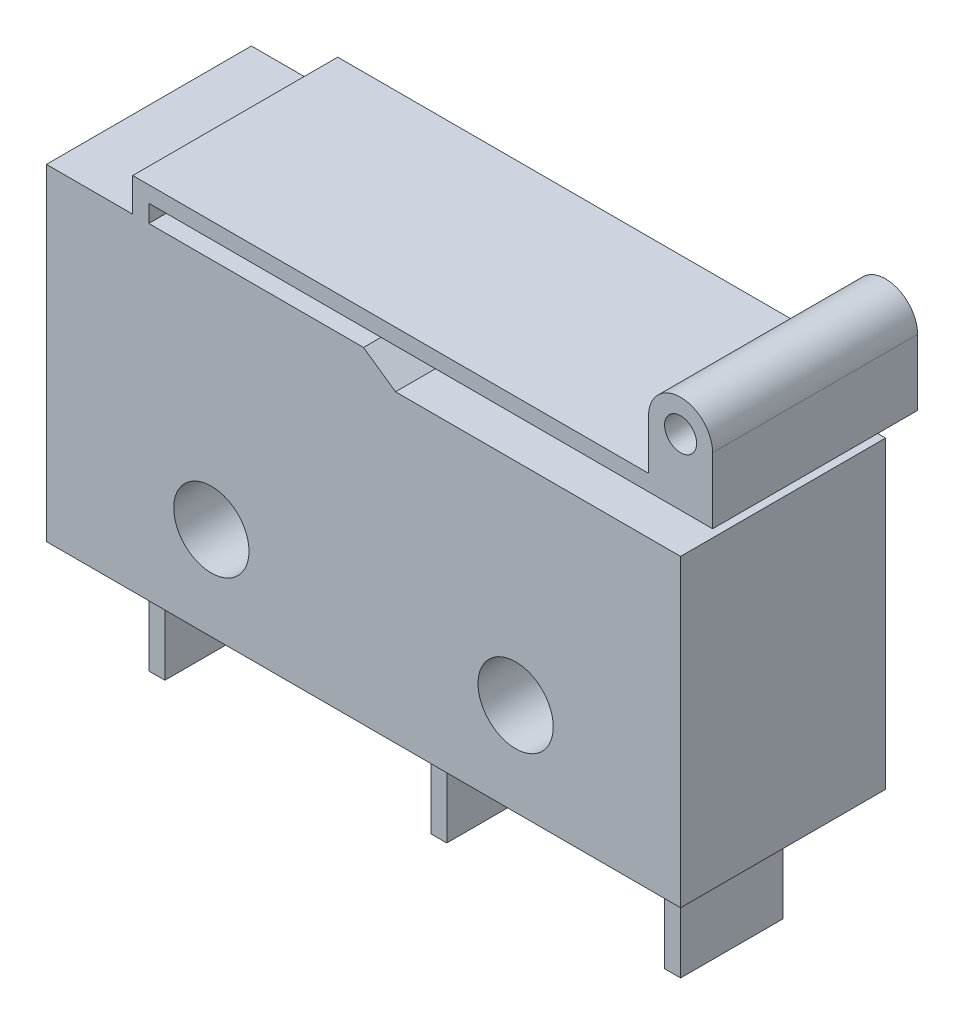
ISO-10303-21;
HEADER;
FILE_DESCRIPTION(('STEP AP214'),'2;1');
FILE_NAME('part.step','',(''),(''),'','','');
FILE_SCHEMA(('AUTOMOTIVE_DESIGN { 1 0 10303 214 1 1 1 1 }'));
ENDSEC;
DATA;
#1=APPLICATION_CONTEXT('core data for automotive mechanical design processes');
#2=APPLICATION_PROTOCOL_DEFINITION('international standard','automotive_design',2000,#1);
#3=PRODUCT_CONTEXT('',#1,'mechanical');
#4=PRODUCT('Part','Part','',(#3));
#5=PRODUCT_RELATED_PRODUCT_CATEGORY('part','',(#4));
#6=PRODUCT_DEFINITION_FORMATION('','',#4);
#7=PRODUCT_DEFINITION_CONTEXT('part definition',#1,'design');
#8=PRODUCT_DEFINITION('design','',#6,#7);
#9=PRODUCT_DEFINITION_SHAPE('','',#8);
#10=(LENGTH_UNIT() NAMED_UNIT(*) SI_UNIT(.MILLI.,.METRE.));
#11=(NAMED_UNIT(*) PLANE_ANGLE_UNIT() SI_UNIT($,.RADIAN.));
#12=(NAMED_UNIT(*) SI_UNIT($,.STERADIAN.) SOLID_ANGLE_UNIT());
#13=UNCERTAINTY_MEASURE_WITH_UNIT(LENGTH_MEASURE(1.E-05),#10,'distance_accuracy_value','');
#14=(GEOMETRIC_REPRESENTATION_CONTEXT(3) GLOBAL_UNCERTAINTY_ASSIGNED_CONTEXT((#13)) GLOBAL_UNIT_ASSIGNED_CONTEXT((#10,
#11,#12)) REPRESENTATION_CONTEXT('',''));
#15=CARTESIAN_POINT('',(0.,0.,0.));
#16=DIRECTION('',(0.,0.,1.));
#17=DIRECTION('',(1.,0.,0.));
#18=AXIS2_PLACEMENT_3D('',#15,#16,#17);
#19=CARTESIAN_POINT('',(19.8,12.8032285899256,6.4));
#20=DIRECTION('',(0.,0.,1.));
#21=DIRECTION('',(1.,0.,0.));
#22=AXIS2_PLACEMENT_3D('',#19,#20,#21);
#23=PLANE('',#22);
#24=DIRECTION('',(1.,0.,0.));
#25=VECTOR('',#24,1.);
#26=CARTESIAN_POINT('',(19.8,9.5,6.4));
#27=LINE('',#26,#25);
#28=CARTESIAN_POINT('',(10.9,9.5,6.4));
#29=VERTEX_POINT('',#28);
#30=CARTESIAN_POINT('',(19.8,9.5,6.4));
#31=VERTEX_POINT('',#30);
#32=EDGE_CURVE('E233',#29,#31,#27,.T.);
#33=ORIENTED_EDGE('',*,*,#32,.F.);
#34=DIRECTION('',(0.81923192051904,-0.573462344363329,0.));
#35=VECTOR('',#34,1.);
#36=CARTESIAN_POINT('',(10.9,9.5,6.4));
#37=LINE('',#36,#35);
#38=CARTESIAN_POINT('',(9.9,10.2,6.4));
#39=VERTEX_POINT('',#38);
#40=EDGE_CURVE('E214',#39,#29,#37,.T.);
#41=ORIENTED_EDGE('',*,*,#40,.F.);
#42=DIRECTION('',(-1.,0.,0.));
#43=VECTOR('',#42,1.);
#44=CARTESIAN_POINT('',(3.19571758878158,10.2,6.4));
#45=LINE('',#44,#43);
#46=CARTESIAN_POINT('',(3.19571758878158,10.2,6.4));
#47=VERTEX_POINT('',#46);
#48=EDGE_CURVE('E319',#39,#47,#45,.T.);
#49=ORIENTED_EDGE('',*,*,#48,.T.);
#50=DIRECTION('',(0.,1.,0.));
#51=VECTOR('',#50,1.);
#52=CARTESIAN_POINT('',(3.19571758878158,10.2,6.4));
#53=LINE('',#52,#51);
#54=CARTESIAN_POINT('',(3.19571758878158,10.7462826879911,6.4));
#55=VERTEX_POINT('',#54);
#56=EDGE_CURVE('E321',#47,#55,#53,.T.);
#57=ORIENTED_EDGE('',*,*,#56,.T.);
#58=DIRECTION('',(1.,0.,0.));
#59=VECTOR('',#58,1.);
#60=CARTESIAN_POINT('',(3.19571758878158,10.7462826879911,6.4));
#61=LINE('',#60,#59);
#62=CARTESIAN_POINT('',(20.8,10.7462826879911,6.4));
#63=VERTEX_POINT('',#62);
#64=EDGE_CURVE('E323',#55,#63,#61,.T.);
#65=ORIENTED_EDGE('',*,*,#64,.T.);
#66=DIRECTION('',(0.,1.,0.));
#67=VECTOR('',#66,1.);
#68=CARTESIAN_POINT('',(20.8,12.8032285899256,6.4));
#69=LINE('',#68,#67);
#70=CARTESIAN_POINT('',(20.8,12.8032285899256,6.4));
#71=VERTEX_POINT('',#70);
#72=EDGE_CURVE('E325',#63,#71,#69,.T.);
#73=ORIENTED_EDGE('',*,*,#72,.T.);
#74=CARTESIAN_POINT('',(19.8,12.8032285899256,6.4));
#75=DIRECTION('',(0.,0.,1.));
#76=DIRECTION('',(1.,0.,0.));
#77=AXIS2_PLACEMENT_3D('',#74,#75,#76);
#78=CIRCLE('',#77,1.);
#79=CARTESIAN_POINT('',(18.8,12.8032285899256,6.4));
#80=VERTEX_POINT('',#79);
#81=EDGE_CURVE('E327',#71,#80,#78,.T.);
#82=ORIENTED_EDGE('',*,*,#81,.T.);
#83=DIRECTION('',(0.,-1.,0.));
#84=VECTOR('',#83,1.);
#85=CARTESIAN_POINT('',(18.8,12.8032285899256,6.4));
#86=LINE('',#85,#84);
#87=CARTESIAN_POINT('',(18.8,11.2462826879911,6.4));
#88=VERTEX_POINT('',#87);
#89=EDGE_CURVE('E329',#80,#88,#86,.T.);
#90=ORIENTED_EDGE('',*,*,#89,.T.);
#91=DIRECTION('',(-1.,0.,0.));
#92=VECTOR('',#91,1.);
#93=CARTESIAN_POINT('',(18.8,11.2462826879911,6.4));
#94=LINE('',#93,#92);
#95=CARTESIAN_POINT('',(2.69571758878158,11.2462826879911,6.4));
#96=VERTEX_POINT('',#95);
#97=EDGE_CURVE('E331',#88,#96,#94,.T.);
#98=ORIENTED_EDGE('',*,*,#97,.T.);
#99=DIRECTION('',(0.,-1.,0.));
#100=VECTOR('',#99,1.);
#101=CARTESIAN_POINT('',(2.69571758878158,11.2462826879911,6.4));
#102=LINE('',#101,#100);
#103=CARTESIAN_POINT('',(2.69571758878158,10.2,6.4));
#104=VERTEX_POINT('',#103);
#105=EDGE_CURVE('E333',#96,#104,#102,.T.);
#106=ORIENTED_EDGE('',*,*,#105,.T.);
#107=DIRECTION('',(-1.,0.,0.));
#108=VECTOR('',#107,1.);
#109=CARTESIAN_POINT('',(0.,10.2,6.4));
#110=LINE('',#109,#108);
#111=CARTESIAN_POINT('',(0.,10.2,6.4));
#112=VERTEX_POINT('',#111);
#113=EDGE_CURVE('E335',#104,#112,#110,.T.);
#114=ORIENTED_EDGE('',*,*,#113,.T.);
#115=DIRECTION('',(0.,-1.,0.));
#116=VECTOR('',#115,1.);
#117=CARTESIAN_POINT('',(0.,0.,6.4));
#118=LINE('',#117,#116);
#119=CARTESIAN_POINT('',(0.,0.,6.4));
#120=VERTEX_POINT('',#119);
#121=EDGE_CURVE('E310',#112,#120,#118,.T.);
#122=ORIENTED_EDGE('',*,*,#121,.T.);
#123=DIRECTION('',(1.,0.,0.));
#124=VECTOR('',#123,1.);
#125=CARTESIAN_POINT('',(0.,0.,6.4));
#126=LINE('',#125,#124);
#127=CARTESIAN_POINT('',(19.8,0.,6.4));
#128=VERTEX_POINT('',#127);
#129=EDGE_CURVE('E313',#120,#128,#126,.T.);
#130=ORIENTED_EDGE('',*,*,#129,.T.);
#131=DIRECTION('',(0.,1.,0.));
#132=VECTOR('',#131,1.);
#133=CARTESIAN_POINT('',(19.8,0.,6.4));
#134=LINE('',#133,#132);
#135=EDGE_CURVE('E316',#128,#31,#134,.T.);
#136=ORIENTED_EDGE('',*,*,#135,.T.);
#137=EDGE_LOOP('',(#33,#41,#49,#57,#65,#73,#82,#90,#98,#106,#114,#122,#130,#136));
#138=FACE_BOUND('',#137,.T.);
#139=CARTESIAN_POINT('',(14.65,2.9,6.4));
#140=DIRECTION('',(0.,0.,1.));
#141=DIRECTION('',(1.,0.,0.));
#142=AXIS2_PLACEMENT_3D('',#139,#140,#141);
#143=CIRCLE('',#142,1.17499999999999);
#144=CARTESIAN_POINT('',(15.825,2.9,6.4));
#145=VERTEX_POINT('',#144);
#146=EDGE_CURVE('E298',#145,#145,#143,.T.);
#147=ORIENTED_EDGE('',*,*,#146,.F.);
#148=EDGE_LOOP('',(#147));
#149=FACE_BOUND('',#148,.T.);
#150=CARTESIAN_POINT('',(5.15,2.9,6.4));
#151=DIRECTION('',(0.,0.,1.));
#152=DIRECTION('',(1.,0.,0.));
#153=AXIS2_PLACEMENT_3D('',#150,#151,#152);
#154=CIRCLE('',#153,1.175);
#155=CARTESIAN_POINT('',(6.325,2.9,6.4));
#156=VERTEX_POINT('',#155);
#157=EDGE_CURVE('E304',#156,#156,#154,.T.);
#158=ORIENTED_EDGE('',*,*,#157,.F.);
#159=EDGE_LOOP('',(#158));
#160=FACE_BOUND('',#159,.T.);
#161=CARTESIAN_POINT('',(19.8,12.8032285899256,6.4));
#162=DIRECTION('',(0.,0.,1.));
#163=DIRECTION('',(1.,0.,0.));
#164=AXIS2_PLACEMENT_3D('',#161,#162,#163);
#165=CIRCLE('',#164,0.499999999999999);
#166=CARTESIAN_POINT('',(20.3,12.8032285899256,6.4));
#167=VERTEX_POINT('',#166);
#168=EDGE_CURVE('E292',#167,#167,#165,.T.);
#169=ORIENTED_EDGE('',*,*,#168,.F.);
#170=EDGE_LOOP('',(#169));
#171=FACE_BOUND('',#170,.T.);
#172=ADVANCED_FACE('F40',(#138,#149,#160,#171),#23,.T.);
#173=CARTESIAN_POINT('',(19.8,12.8032285899256,0.));
#174=DIRECTION('',(0.,0.,1.));
#175=DIRECTION('',(1.,0.,0.));
#176=AXIS2_PLACEMENT_3D('',#173,#174,#175);
#177=PLANE('',#176);
#178=DIRECTION('',(0.81923192051904,-0.573462344363329,0.));
#179=VECTOR('',#178,1.);
#180=CARTESIAN_POINT('',(10.9,9.5,0.));
#181=LINE('',#180,#179);
#182=CARTESIAN_POINT('',(9.9,10.2,0.));
#183=VERTEX_POINT('',#182);
#184=CARTESIAN_POINT('',(10.9,9.5,0.));
#185=VERTEX_POINT('',#184);
#186=EDGE_CURVE('E55',#183,#185,#181,.T.);
#187=ORIENTED_EDGE('',*,*,#186,.T.);
#188=DIRECTION('',(1.,0.,0.));
#189=VECTOR('',#188,1.);
#190=CARTESIAN_POINT('',(19.8,9.5,0.));
#191=LINE('',#190,#189);
#192=CARTESIAN_POINT('',(19.8,9.5,0.));
#193=VERTEX_POINT('',#192);
#194=EDGE_CURVE('E221',#185,#193,#191,.T.);
#195=ORIENTED_EDGE('',*,*,#194,.T.);
#196=DIRECTION('',(0.,1.,0.));
#197=VECTOR('',#196,1.);
#198=CARTESIAN_POINT('',(19.8,0.,0.));
#199=LINE('',#198,#197);
#200=CARTESIAN_POINT('',(19.8,0.,0.));
#201=VERTEX_POINT('',#200);
#202=EDGE_CURVE('E343',#201,#193,#199,.T.);
#203=ORIENTED_EDGE('',*,*,#202,.F.);
#204=DIRECTION('',(1.,0.,0.));
#205=VECTOR('',#204,1.);
#206=CARTESIAN_POINT('',(18.2,0.,0.));
#207=LINE('',#206,#205);
#208=CARTESIAN_POINT('',(0.,0.,0.));
#209=VERTEX_POINT('',#208);
#210=EDGE_CURVE('E340',#209,#201,#207,.T.);
#211=ORIENTED_EDGE('',*,*,#210,.F.);
#212=DIRECTION('',(0.,-1.,0.));
#213=VECTOR('',#212,1.);
#214=CARTESIAN_POINT('',(0.,0.,0.));
#215=LINE('',#214,#213);
#216=CARTESIAN_POINT('',(0.,10.2,0.));
#217=VERTEX_POINT('',#216);
#218=EDGE_CURVE('E307',#217,#209,#215,.T.);
#219=ORIENTED_EDGE('',*,*,#218,.F.);
#220=DIRECTION('',(-1.,0.,0.));
#221=VECTOR('',#220,1.);
#222=CARTESIAN_POINT('',(0.,10.2,0.));
#223=LINE('',#222,#221);
#224=CARTESIAN_POINT('',(2.69571758878158,10.2,0.));
#225=VERTEX_POINT('',#224);
#226=EDGE_CURVE('E314',#225,#217,#223,.T.);
#227=ORIENTED_EDGE('',*,*,#226,.F.);
#228=DIRECTION('',(0.,-1.,0.));
#229=VECTOR('',#228,1.);
#230=CARTESIAN_POINT('',(2.69571758878158,11.2462826879911,0.));
#231=LINE('',#230,#229);
#232=CARTESIAN_POINT('',(2.69571758878158,11.2462826879911,0.));
#233=VERTEX_POINT('',#232);
#234=EDGE_CURVE('E358',#233,#225,#231,.T.);
#235=ORIENTED_EDGE('',*,*,#234,.F.);
#236=DIRECTION('',(-1.,0.,0.));
#237=VECTOR('',#236,1.);
#238=CARTESIAN_POINT('',(18.8,11.2462826879911,0.));
#239=LINE('',#238,#237);
#240=CARTESIAN_POINT('',(18.8,11.2462826879911,0.));
#241=VERTEX_POINT('',#240);
#242=EDGE_CURVE('E356',#241,#233,#239,.T.);
#243=ORIENTED_EDGE('',*,*,#242,.F.);
#244=DIRECTION('',(0.,-1.,0.));
#245=VECTOR('',#244,1.);
#246=CARTESIAN_POINT('',(18.8,12.8032285899256,0.));
#247=LINE('',#246,#245);
#248=CARTESIAN_POINT('',(18.8,12.8032285899256,0.));
#249=VERTEX_POINT('',#248);
#250=EDGE_CURVE('E354',#249,#241,#247,.T.);
#251=ORIENTED_EDGE('',*,*,#250,.F.);
#252=CARTESIAN_POINT('',(19.8,12.8032285899256,0.));
#253=DIRECTION('',(0.,0.,1.));
#254=DIRECTION('',(1.,0.,0.));
#255=AXIS2_PLACEMENT_3D('',#252,#253,#254);
#256=CIRCLE('',#255,1.);
#257=CARTESIAN_POINT('',(20.8,12.8032285899256,0.));
#258=VERTEX_POINT('',#257);
#259=EDGE_CURVE('E352',#258,#249,#256,.T.);
#260=ORIENTED_EDGE('',*,*,#259,.F.);
#261=DIRECTION('',(0.,1.,0.));
#262=VECTOR('',#261,1.);
#263=CARTESIAN_POINT('',(20.8,12.8032285899256,0.));
#264=LINE('',#263,#262);
#265=CARTESIAN_POINT('',(20.8,10.7462826879911,0.));
#266=VERTEX_POINT('',#265);
#267=EDGE_CURVE('E350',#266,#258,#264,.T.);
#268=ORIENTED_EDGE('',*,*,#267,.F.);
#269=DIRECTION('',(1.,0.,0.));
#270=VECTOR('',#269,1.);
#271=CARTESIAN_POINT('',(3.19571758878158,10.7462826879911,0.));
#272=LINE('',#271,#270);
#273=CARTESIAN_POINT('',(3.19571758878158,10.7462826879911,0.));
#274=VERTEX_POINT('',#273);
#275=EDGE_CURVE('E348',#274,#266,#272,.T.);
#276=ORIENTED_EDGE('',*,*,#275,.F.);
#277=DIRECTION('',(0.,1.,0.));
#278=VECTOR('',#277,1.);
#279=CARTESIAN_POINT('',(3.19571758878158,10.2,0.));
#280=LINE('',#279,#278);
#281=CARTESIAN_POINT('',(3.19571758878158,10.2,0.));
#282=VERTEX_POINT('',#281);
#283=EDGE_CURVE('E346',#282,#274,#280,.T.);
#284=ORIENTED_EDGE('',*,*,#283,.F.);
#285=DIRECTION('',(-1.,0.,0.));
#286=VECTOR('',#285,1.);
#287=CARTESIAN_POINT('',(3.19571758878158,10.2,0.));
#288=LINE('',#287,#286);
#289=EDGE_CURVE('E232',#183,#282,#288,.T.);
#290=ORIENTED_EDGE('',*,*,#289,.F.);
#291=EDGE_LOOP('',(#187,#195,#203,#211,#219,#227,#235,#243,#251,#260,#268,#276,#284,#290));
#292=FACE_BOUND('',#291,.T.);
#293=CARTESIAN_POINT('',(5.15,2.9,0.));
#294=DIRECTION('',(0.,0.,1.));
#295=DIRECTION('',(1.,0.,0.));
#296=AXIS2_PLACEMENT_3D('',#293,#294,#295);
#297=CIRCLE('',#296,1.175);
#298=CARTESIAN_POINT('',(6.325,2.9,0.));
#299=VERTEX_POINT('',#298);
#300=EDGE_CURVE('E301',#299,#299,#297,.T.);
#301=ORIENTED_EDGE('',*,*,#300,.T.);
#302=EDGE_LOOP('',(#301));
#303=FACE_BOUND('',#302,.T.);
#304=CARTESIAN_POINT('',(14.65,2.9,0.));
#305=DIRECTION('',(0.,0.,1.));
#306=DIRECTION('',(1.,0.,0.));
#307=AXIS2_PLACEMENT_3D('',#304,#305,#306);
#308=CIRCLE('',#307,1.17499999999999);
#309=CARTESIAN_POINT('',(15.825,2.9,0.));
#310=VERTEX_POINT('',#309);
#311=EDGE_CURVE('E295',#310,#310,#308,.T.);
#312=ORIENTED_EDGE('',*,*,#311,.T.);
#313=EDGE_LOOP('',(#312));
#314=FACE_BOUND('',#313,.T.);
#315=CARTESIAN_POINT('',(19.8,12.8032285899256,0.));
#316=DIRECTION('',(0.,0.,1.));
#317=DIRECTION('',(1.,0.,0.));
#318=AXIS2_PLACEMENT_3D('',#315,#316,#317);
#319=CIRCLE('',#318,0.499999999999999);
#320=CARTESIAN_POINT('',(20.3,12.8032285899256,0.));
#321=VERTEX_POINT('',#320);
#322=EDGE_CURVE('E291',#321,#321,#319,.T.);
#323=ORIENTED_EDGE('',*,*,#322,.T.);
#324=EDGE_LOOP('',(#323));
#325=FACE_BOUND('',#324,.T.);
#326=ADVANCED_FACE('F229',(#292,#303,#314,#325),#177,.F.);
#327=CARTESIAN_POINT('',(0.,0.,6.4));
#328=DIRECTION('',(1.,0.,0.));
#329=DIRECTION('',(0.,0.,-1.));
#330=AXIS2_PLACEMENT_3D('',#327,#328,#329);
#331=PLANE('',#330);
#332=ORIENTED_EDGE('',*,*,#218,.T.);
#333=DIRECTION('',(0.,0.,-1.));
#334=VECTOR('',#333,1.);
#335=CARTESIAN_POINT('',(0.,0.,6.4));
#336=LINE('',#335,#334);
#337=EDGE_CURVE('E11',#120,#209,#336,.T.);
#338=ORIENTED_EDGE('',*,*,#337,.F.);
#339=ORIENTED_EDGE('',*,*,#121,.F.);
#340=DIRECTION('',(0.,0.,-1.));
#341=VECTOR('',#340,1.);
#342=CARTESIAN_POINT('',(0.,10.2,6.4));
#343=LINE('',#342,#341);
#344=EDGE_CURVE('E337',#112,#217,#343,.T.);
#345=ORIENTED_EDGE('',*,*,#344,.T.);
#346=EDGE_LOOP('',(#332,#338,#339,#345));
#347=FACE_BOUND('',#346,.T.);
#348=ADVANCED_FACE('F42',(#347),#331,.F.);
#349=CARTESIAN_POINT('',(1.6,0.,6.4));
#350=DIRECTION('',(1.,0.,0.));
#351=DIRECTION('',(0.,1.,0.));
#352=AXIS2_PLACEMENT_3D('',#349,#350,#351);
#353=PLANE('',#352);
#354=DIRECTION('',(0.,0.,-1.));
#355=VECTOR('',#354,1.);
#356=CARTESIAN_POINT('',(1.6,0.,6.4));
#357=LINE('',#356,#355);
#358=CARTESIAN_POINT('',(1.6,0.,4.8));
#359=VERTEX_POINT('',#358);
#360=CARTESIAN_POINT('',(1.6,0.,1.6));
#361=VERTEX_POINT('',#360);
#362=EDGE_CURVE('E48',#359,#361,#357,.T.);
#363=ORIENTED_EDGE('',*,*,#362,.T.);
#364=DIRECTION('',(0.,-1.,0.));
#365=VECTOR('',#364,1.);
#366=CARTESIAN_POINT('',(1.6,0.,1.6));
#367=LINE('',#366,#365);
#368=CARTESIAN_POINT('',(1.6,-3.5,1.6));
#369=VERTEX_POINT('',#368);
#370=EDGE_CURVE('E288',#361,#369,#367,.T.);
#371=ORIENTED_EDGE('',*,*,#370,.T.);
#372=DIRECTION('',(0.,0.,-1.));
#373=VECTOR('',#372,1.);
#374=CARTESIAN_POINT('',(1.6,-3.5,6.4));
#375=LINE('',#374,#373);
#376=CARTESIAN_POINT('',(1.6,-3.5,4.8));
#377=VERTEX_POINT('',#376);
#378=EDGE_CURVE('E419',#377,#369,#375,.T.);
#379=ORIENTED_EDGE('',*,*,#378,.F.);
#380=DIRECTION('',(0.,1.,0.));
#381=VECTOR('',#380,1.);
#382=CARTESIAN_POINT('',(1.6,0.,4.8));
#383=LINE('',#382,#381);
#384=EDGE_CURVE('E271',#377,#359,#383,.T.);
#385=ORIENTED_EDGE('',*,*,#384,.T.);
#386=EDGE_LOOP('',(#363,#371,#379,#385));
#387=FACE_BOUND('',#386,.T.);
#388=ADVANCED_FACE('F424',(#387),#353,.F.);
#389=CARTESIAN_POINT('',(1.6,-3.5,6.4));
#390=DIRECTION('',(0.,1.,0.));
#391=DIRECTION('',(0.,0.,1.));
#392=AXIS2_PLACEMENT_3D('',#389,#390,#391);
#393=PLANE('',#392);
#394=ORIENTED_EDGE('',*,*,#378,.T.);
#395=DIRECTION('',(-1.,0.,0.));
#396=VECTOR('',#395,1.);
#397=CARTESIAN_POINT('',(20.8,-3.5,1.6));
#398=LINE('',#397,#396);
#399=CARTESIAN_POINT('',(2.1,-3.5,1.6));
#400=VERTEX_POINT('',#399);
#401=EDGE_CURVE('E245',#400,#369,#398,.T.);
#402=ORIENTED_EDGE('',*,*,#401,.F.);
#403=DIRECTION('',(0.,0.,-1.));
#404=VECTOR('',#403,1.);
#405=CARTESIAN_POINT('',(2.1,-3.5,6.4));
#406=LINE('',#405,#404);
#407=CARTESIAN_POINT('',(2.1,-3.5,4.8));
#408=VERTEX_POINT('',#407);
#409=EDGE_CURVE('E416',#408,#400,#406,.T.);
#410=ORIENTED_EDGE('',*,*,#409,.F.);
#411=DIRECTION('',(-1.,0.,0.));
#412=VECTOR('',#411,1.);
#413=CARTESIAN_POINT('',(20.8,-3.5,4.8));
#414=LINE('',#413,#412);
#415=EDGE_CURVE('E249',#408,#377,#414,.T.);
#416=ORIENTED_EDGE('',*,*,#415,.T.);
#417=EDGE_LOOP('',(#394,#402,#410,#416));
#418=FACE_BOUND('',#417,.T.);
#419=ADVANCED_FACE('F437',(#418),#393,.F.);
#420=CARTESIAN_POINT('',(2.1,0.,6.4));
#421=DIRECTION('',(-1.,0.,0.));
#422=DIRECTION('',(0.,0.,1.));
#423=AXIS2_PLACEMENT_3D('',#420,#421,#422);
#424=PLANE('',#423);
#425=ORIENTED_EDGE('',*,*,#409,.T.);
#426=DIRECTION('',(0.,1.,0.));
#427=VECTOR('',#426,1.);
#428=CARTESIAN_POINT('',(2.1,0.,1.6));
#429=LINE('',#428,#427);
#430=CARTESIAN_POINT('',(2.1,0.,1.6));
#431=VERTEX_POINT('',#430);
#432=EDGE_CURVE('E286',#400,#431,#429,.T.);
#433=ORIENTED_EDGE('',*,*,#432,.T.);
#434=DIRECTION('',(0.,0.,-1.));
#435=VECTOR('',#434,1.);
#436=CARTESIAN_POINT('',(2.1,0.,6.4));
#437=LINE('',#436,#435);
#438=CARTESIAN_POINT('',(2.1,0.,4.8));
#439=VERTEX_POINT('',#438);
#440=EDGE_CURVE('E413',#439,#431,#437,.T.);
#441=ORIENTED_EDGE('',*,*,#440,.F.);
#442=DIRECTION('',(0.,-1.,0.));
#443=VECTOR('',#442,1.);
#444=CARTESIAN_POINT('',(2.1,0.,4.8));
#445=LINE('',#444,#443);
#446=EDGE_CURVE('E268',#439,#408,#445,.T.);
#447=ORIENTED_EDGE('',*,*,#446,.T.);
#448=EDGE_LOOP('',(#425,#433,#441,#447));
#449=FACE_BOUND('',#448,.T.);
#450=ADVANCED_FACE('F432',(#449),#424,.F.);
#451=CARTESIAN_POINT('',(10.4,0.,6.4));
#452=DIRECTION('',(1.,0.,0.));
#453=DIRECTION('',(0.,0.,-1.));
#454=AXIS2_PLACEMENT_3D('',#451,#452,#453);
#455=PLANE('',#454);
#456=DIRECTION('',(0.,0.,-1.));
#457=VECTOR('',#456,1.);
#458=CARTESIAN_POINT('',(10.4,0.,6.4));
#459=LINE('',#458,#457);
#460=CARTESIAN_POINT('',(10.4,0.,4.8));
#461=VERTEX_POINT('',#460);
#462=CARTESIAN_POINT('',(10.4,0.,1.6));
#463=VERTEX_POINT('',#462);
#464=EDGE_CURVE('E410',#461,#463,#459,.T.);
#465=ORIENTED_EDGE('',*,*,#464,.T.);
#466=DIRECTION('',(0.,-1.,0.));
#467=VECTOR('',#466,1.);
#468=CARTESIAN_POINT('',(10.4,0.,1.6));
#469=LINE('',#468,#467);
#470=CARTESIAN_POINT('',(10.4,-3.5,1.6));
#471=VERTEX_POINT('',#470);
#472=EDGE_CURVE('E283',#463,#471,#469,.T.);
#473=ORIENTED_EDGE('',*,*,#472,.T.);
#474=DIRECTION('',(0.,0.,-1.));
#475=VECTOR('',#474,1.);
#476=CARTESIAN_POINT('',(10.4,-3.5,6.4));
#477=LINE('',#476,#475);
#478=CARTESIAN_POINT('',(10.4,-3.5,4.8));
#479=VERTEX_POINT('',#478);
#480=EDGE_CURVE('E407',#479,#471,#477,.T.);
#481=ORIENTED_EDGE('',*,*,#480,.F.);
#482=DIRECTION('',(0.,1.,0.));
#483=VECTOR('',#482,1.);
#484=CARTESIAN_POINT('',(10.4,0.,4.8));
#485=LINE('',#484,#483);
#486=EDGE_CURVE('E265',#479,#461,#485,.T.);
#487=ORIENTED_EDGE('',*,*,#486,.T.);
#488=EDGE_LOOP('',(#465,#473,#481,#487));
#489=FACE_BOUND('',#488,.T.);
#490=ADVANCED_FACE('F530',(#489),#455,.F.);
#491=CARTESIAN_POINT('',(10.4,-3.5,6.4));
#492=DIRECTION('',(0.,1.,0.));
#493=DIRECTION('',(0.,0.,1.));
#494=AXIS2_PLACEMENT_3D('',#491,#492,#493);
#495=PLANE('',#494);
#496=ORIENTED_EDGE('',*,*,#480,.T.);
#497=CARTESIAN_POINT('',(10.9,-3.5,1.6));
#498=VERTEX_POINT('',#497);
#499=EDGE_CURVE('E247',#498,#471,#398,.T.);
#500=ORIENTED_EDGE('',*,*,#499,.F.);
#501=DIRECTION('',(0.,0.,-1.));
#502=VECTOR('',#501,1.);
#503=CARTESIAN_POINT('',(10.9,-3.5,6.4));
#504=LINE('',#503,#502);
#505=CARTESIAN_POINT('',(10.9,-3.5,4.8));
#506=VERTEX_POINT('',#505);
#507=EDGE_CURVE('E404',#506,#498,#504,.T.);
#508=ORIENTED_EDGE('',*,*,#507,.F.);
#509=EDGE_CURVE('E252',#506,#479,#414,.T.);
#510=ORIENTED_EDGE('',*,*,#509,.T.);
#511=EDGE_LOOP('',(#496,#500,#508,#510));
#512=FACE_BOUND('',#511,.T.);
#513=ADVANCED_FACE('F526',(#512),#495,.F.);
#514=CARTESIAN_POINT('',(10.9,0.,6.4));
#515=DIRECTION('',(-1.,0.,0.));
#516=DIRECTION('',(0.,-1.,0.));
#517=AXIS2_PLACEMENT_3D('',#514,#515,#516);
#518=PLANE('',#517);
#519=ORIENTED_EDGE('',*,*,#507,.T.);
#520=DIRECTION('',(0.,1.,0.));
#521=VECTOR('',#520,1.);
#522=CARTESIAN_POINT('',(10.9,0.,1.6));
#523=LINE('',#522,#521);
#524=CARTESIAN_POINT('',(10.9,0.,1.6));
#525=VERTEX_POINT('',#524);
#526=EDGE_CURVE('E280',#498,#525,#523,.T.);
#527=ORIENTED_EDGE('',*,*,#526,.T.);
#528=DIRECTION('',(0.,0.,-1.));
#529=VECTOR('',#528,1.);
#530=CARTESIAN_POINT('',(10.9,0.,6.4));
#531=LINE('',#530,#529);
#532=CARTESIAN_POINT('',(10.9,0.,4.8));
#533=VERTEX_POINT('',#532);
#534=EDGE_CURVE('E401',#533,#525,#531,.T.);
#535=ORIENTED_EDGE('',*,*,#534,.F.);
#536=DIRECTION('',(0.,-1.,0.));
#537=VECTOR('',#536,1.);
#538=CARTESIAN_POINT('',(10.9,0.,4.8));
#539=LINE('',#538,#537);
#540=EDGE_CURVE('E262',#533,#506,#539,.T.);
#541=ORIENTED_EDGE('',*,*,#540,.T.);
#542=EDGE_LOOP('',(#519,#527,#535,#541));
#543=FACE_BOUND('',#542,.T.);
#544=ADVANCED_FACE('F522',(#543),#518,.F.);
#545=CARTESIAN_POINT('',(17.7,0.,6.4));
#546=DIRECTION('',(1.,0.,0.));
#547=DIRECTION('',(0.,0.,-1.));
#548=AXIS2_PLACEMENT_3D('',#545,#546,#547);
#549=PLANE('',#548);
#550=DIRECTION('',(0.,0.,-1.));
#551=VECTOR('',#550,1.);
#552=CARTESIAN_POINT('',(17.7,0.,6.4));
#553=LINE('',#552,#551);
#554=CARTESIAN_POINT('',(17.7,0.,4.8));
#555=VERTEX_POINT('',#554);
#556=CARTESIAN_POINT('',(17.7,0.,1.6));
#557=VERTEX_POINT('',#556);
#558=EDGE_CURVE('E398',#555,#557,#553,.T.);
#559=ORIENTED_EDGE('',*,*,#558,.T.);
#560=DIRECTION('',(0.,-1.,0.));
#561=VECTOR('',#560,1.);
#562=CARTESIAN_POINT('',(17.7,0.,1.6));
#563=LINE('',#562,#561);
#564=CARTESIAN_POINT('',(17.7,-3.5,1.6));
#565=VERTEX_POINT('',#564);
#566=EDGE_CURVE('E277',#557,#565,#563,.T.);
#567=ORIENTED_EDGE('',*,*,#566,.T.);
#568=DIRECTION('',(0.,0.,-1.));
#569=VECTOR('',#568,1.);
#570=CARTESIAN_POINT('',(17.7,-3.5,6.4));
#571=LINE('',#570,#569);
#572=CARTESIAN_POINT('',(17.7,-3.5,4.8));
#573=VERTEX_POINT('',#572);
#574=EDGE_CURVE('E395',#573,#565,#571,.T.);
#575=ORIENTED_EDGE('',*,*,#574,.F.);
#576=DIRECTION('',(0.,1.,0.));
#577=VECTOR('',#576,1.);
#578=CARTESIAN_POINT('',(17.7,0.,4.8));
#579=LINE('',#578,#577);
#580=EDGE_CURVE('E259',#573,#555,#579,.T.);
#581=ORIENTED_EDGE('',*,*,#580,.T.);
#582=EDGE_LOOP('',(#559,#567,#575,#581));
#583=FACE_BOUND('',#582,.T.);
#584=ADVANCED_FACE('F518',(#583),#549,.F.);
#585=CARTESIAN_POINT('',(17.7,-3.5,6.4));
#586=DIRECTION('',(0.,1.,0.));
#587=DIRECTION('',(0.,0.,1.));
#588=AXIS2_PLACEMENT_3D('',#585,#586,#587);
#589=PLANE('',#588);
#590=ORIENTED_EDGE('',*,*,#574,.T.);
#591=CARTESIAN_POINT('',(18.2,-3.5,1.6));
#592=VERTEX_POINT('',#591);
#593=EDGE_CURVE('E243',#592,#565,#398,.T.);
#594=ORIENTED_EDGE('',*,*,#593,.F.);
#595=DIRECTION('',(0.,0.,-1.));
#596=VECTOR('',#595,1.);
#597=CARTESIAN_POINT('',(18.2,-3.5,6.4));
#598=LINE('',#597,#596);
#599=CARTESIAN_POINT('',(18.2,-3.5,4.8));
#600=VERTEX_POINT('',#599);
#601=EDGE_CURVE('E392',#600,#592,#598,.T.);
#602=ORIENTED_EDGE('',*,*,#601,.F.);
#603=EDGE_CURVE('E248',#600,#573,#414,.T.);
#604=ORIENTED_EDGE('',*,*,#603,.T.);
#605=EDGE_LOOP('',(#590,#594,#602,#604));
#606=FACE_BOUND('',#605,.T.);
#607=ADVANCED_FACE('F514',(#606),#589,.F.);
#608=CARTESIAN_POINT('',(18.2,0.,6.4));
#609=DIRECTION('',(-1.,0.,0.));
#610=DIRECTION('',(0.,0.,1.));
#611=AXIS2_PLACEMENT_3D('',#608,#609,#610);
#612=PLANE('',#611);
#613=ORIENTED_EDGE('',*,*,#601,.T.);
#614=DIRECTION('',(0.,1.,0.));
#615=VECTOR('',#614,1.);
#616=CARTESIAN_POINT('',(18.2,0.,1.6));
#617=LINE('',#616,#615);
#618=CARTESIAN_POINT('',(18.2,0.,1.6));
#619=VERTEX_POINT('',#618);
#620=EDGE_CURVE('E274',#592,#619,#617,.T.);
#621=ORIENTED_EDGE('',*,*,#620,.T.);
#622=DIRECTION('',(0.,0.,-1.));
#623=VECTOR('',#622,1.);
#624=CARTESIAN_POINT('',(18.2,0.,6.4));
#625=LINE('',#624,#623);
#626=CARTESIAN_POINT('',(18.2,0.,4.8));
#627=VERTEX_POINT('',#626);
#628=EDGE_CURVE('E389',#627,#619,#625,.T.);
#629=ORIENTED_EDGE('',*,*,#628,.F.);
#630=DIRECTION('',(0.,-1.,0.));
#631=VECTOR('',#630,1.);
#632=CARTESIAN_POINT('',(18.2,0.,4.8));
#633=LINE('',#632,#631);
#634=EDGE_CURVE('E256',#627,#600,#633,.T.);
#635=ORIENTED_EDGE('',*,*,#634,.T.);
#636=EDGE_LOOP('',(#613,#621,#629,#635));
#637=FACE_BOUND('',#636,.T.);
#638=ADVANCED_FACE('F511',(#637),#612,.F.);
#639=CARTESIAN_POINT('',(18.2,0.,6.4));
#640=DIRECTION('',(0.,1.,0.));
#641=DIRECTION('',(-1.,0.,0.));
#642=AXIS2_PLACEMENT_3D('',#639,#640,#641);
#643=PLANE('',#642);
#644=DIRECTION('',(-1.,0.,0.));
#645=VECTOR('',#644,1.);
#646=CARTESIAN_POINT('',(20.8,0.,1.6));
#647=LINE('',#646,#645);
#648=EDGE_CURVE('E63',#431,#361,#647,.T.);
#649=ORIENTED_EDGE('',*,*,#648,.T.);
#650=ORIENTED_EDGE('',*,*,#362,.F.);
#651=DIRECTION('',(-1.,0.,0.));
#652=VECTOR('',#651,1.);
#653=CARTESIAN_POINT('',(20.8,0.,4.8));
#654=LINE('',#653,#652);
#655=EDGE_CURVE('E238',#439,#359,#654,.T.);
#656=ORIENTED_EDGE('',*,*,#655,.F.);
#657=ORIENTED_EDGE('',*,*,#440,.T.);
#658=EDGE_LOOP('',(#649,#650,#656,#657));
#659=FACE_BOUND('',#658,.T.);
#660=EDGE_CURVE('E242',#525,#463,#647,.T.);
#661=ORIENTED_EDGE('',*,*,#660,.T.);
#662=ORIENTED_EDGE('',*,*,#464,.F.);
#663=EDGE_CURVE('E255',#533,#461,#654,.T.);
#664=ORIENTED_EDGE('',*,*,#663,.F.);
#665=ORIENTED_EDGE('',*,*,#534,.T.);
#666=EDGE_LOOP('',(#661,#662,#664,#665));
#667=FACE_BOUND('',#666,.T.);
#668=EDGE_CURVE('E244',#619,#557,#647,.T.);
#669=ORIENTED_EDGE('',*,*,#668,.T.);
#670=ORIENTED_EDGE('',*,*,#558,.F.);
#671=EDGE_CURVE('E253',#627,#555,#654,.T.);
#672=ORIENTED_EDGE('',*,*,#671,.F.);
#673=ORIENTED_EDGE('',*,*,#628,.T.);
#674=EDGE_LOOP('',(#669,#670,#672,#673));
#675=FACE_BOUND('',#674,.T.);
#676=ORIENTED_EDGE('',*,*,#337,.T.);
#677=ORIENTED_EDGE('',*,*,#210,.T.);
#678=DIRECTION('',(0.,0.,-1.));
#679=VECTOR('',#678,1.);
#680=CARTESIAN_POINT('',(19.8,0.,6.4));
#681=LINE('',#680,#679);
#682=EDGE_CURVE('E387',#128,#201,#681,.T.);
#683=ORIENTED_EDGE('',*,*,#682,.F.);
#684=ORIENTED_EDGE('',*,*,#129,.F.);
#685=EDGE_LOOP('',(#676,#677,#683,#684));
#686=FACE_BOUND('',#685,.T.);
#687=ADVANCED_FACE('F427',(#659,#667,#675,#686),#643,.F.);
#688=CARTESIAN_POINT('',(19.8,0.,6.4));
#689=DIRECTION('',(-1.,0.,0.));
#690=DIRECTION('',(0.,0.,1.));
#691=AXIS2_PLACEMENT_3D('',#688,#689,#690);
#692=PLANE('',#691);
#693=ORIENTED_EDGE('',*,*,#202,.T.);
#694=DIRECTION('',(0.,0.,1.));
#695=VECTOR('',#694,1.);
#696=CARTESIAN_POINT('',(19.8,9.5,0.));
#697=LINE('',#696,#695);
#698=EDGE_CURVE('E217',#193,#31,#697,.T.);
#699=ORIENTED_EDGE('',*,*,#698,.T.);
#700=ORIENTED_EDGE('',*,*,#135,.F.);
#701=ORIENTED_EDGE('',*,*,#682,.T.);
#702=EDGE_LOOP('',(#693,#699,#700,#701));
#703=FACE_BOUND('',#702,.T.);
#704=ADVANCED_FACE('F504',(#703),#692,.F.);
#705=CARTESIAN_POINT('',(3.19571758878158,10.2,6.4));
#706=DIRECTION('',(0.,-1.,0.));
#707=DIRECTION('',(0.,0.,-1.));
#708=AXIS2_PLACEMENT_3D('',#705,#706,#707);
#709=PLANE('',#708);
#710=ORIENTED_EDGE('',*,*,#48,.F.);
#711=DIRECTION('',(0.,0.,1.));
#712=VECTOR('',#711,1.);
#713=CARTESIAN_POINT('',(9.9,10.2,0.));
#714=LINE('',#713,#712);
#715=EDGE_CURVE('E218',#183,#39,#714,.T.);
#716=ORIENTED_EDGE('',*,*,#715,.F.);
#717=ORIENTED_EDGE('',*,*,#289,.T.);
#718=DIRECTION('',(0.,0.,-1.));
#719=VECTOR('',#718,1.);
#720=CARTESIAN_POINT('',(3.19571758878158,10.2,6.4));
#721=LINE('',#720,#719);
#722=EDGE_CURVE('E384',#47,#282,#721,.T.);
#723=ORIENTED_EDGE('',*,*,#722,.F.);
#724=EDGE_LOOP('',(#710,#716,#717,#723));
#725=FACE_BOUND('',#724,.T.);
#726=ADVANCED_FACE('F500',(#725),#709,.F.);
#727=CARTESIAN_POINT('',(3.19571758878158,10.2,6.4));
#728=DIRECTION('',(-1.,0.,0.));
#729=DIRECTION('',(0.,0.,1.));
#730=AXIS2_PLACEMENT_3D('',#727,#728,#729);
#731=PLANE('',#730);
#732=ORIENTED_EDGE('',*,*,#283,.T.);
#733=DIRECTION('',(0.,0.,-1.));
#734=VECTOR('',#733,1.);
#735=CARTESIAN_POINT('',(3.19571758878158,10.7462826879911,6.4));
#736=LINE('',#735,#734);
#737=EDGE_CURVE('E381',#55,#274,#736,.T.);
#738=ORIENTED_EDGE('',*,*,#737,.F.);
#739=ORIENTED_EDGE('',*,*,#56,.F.);
#740=ORIENTED_EDGE('',*,*,#722,.T.);
#741=EDGE_LOOP('',(#732,#738,#739,#740));
#742=FACE_BOUND('',#741,.T.);
#743=ADVANCED_FACE('F496',(#742),#731,.F.);
#744=CARTESIAN_POINT('',(3.19571758878158,10.7462826879911,6.4));
#745=DIRECTION('',(0.,1.,0.));
#746=DIRECTION('',(0.,0.,1.));
#747=AXIS2_PLACEMENT_3D('',#744,#745,#746);
#748=PLANE('',#747);
#749=ORIENTED_EDGE('',*,*,#275,.T.);
#750=DIRECTION('',(0.,0.,-1.));
#751=VECTOR('',#750,1.);
#752=CARTESIAN_POINT('',(20.8,10.7462826879911,6.4));
#753=LINE('',#752,#751);
#754=EDGE_CURVE('E378',#63,#266,#753,.T.);
#755=ORIENTED_EDGE('',*,*,#754,.F.);
#756=ORIENTED_EDGE('',*,*,#64,.F.);
#757=ORIENTED_EDGE('',*,*,#737,.T.);
#758=EDGE_LOOP('',(#749,#755,#756,#757));
#759=FACE_BOUND('',#758,.T.);
#760=ADVANCED_FACE('F492',(#759),#748,.F.);
#761=CARTESIAN_POINT('',(20.8,12.8032285899256,6.4));
#762=DIRECTION('',(-1.,0.,0.));
#763=DIRECTION('',(0.,0.,1.));
#764=AXIS2_PLACEMENT_3D('',#761,#762,#763);
#765=PLANE('',#764);
#766=ORIENTED_EDGE('',*,*,#267,.T.);
#767=DIRECTION('',(0.,0.,-1.));
#768=VECTOR('',#767,1.);
#769=CARTESIAN_POINT('',(20.8,12.8032285899256,6.4));
#770=LINE('',#769,#768);
#771=EDGE_CURVE('E375',#71,#258,#770,.T.);
#772=ORIENTED_EDGE('',*,*,#771,.F.);
#773=ORIENTED_EDGE('',*,*,#72,.F.);
#774=ORIENTED_EDGE('',*,*,#754,.T.);
#775=EDGE_LOOP('',(#766,#772,#773,#774));
#776=FACE_BOUND('',#775,.T.);
#777=ADVANCED_FACE('F488',(#776),#765,.F.);
#778=CARTESIAN_POINT('',(19.8,12.8032285899256,6.4));
#779=DIRECTION('',(0.,0.,-1.));
#780=DIRECTION('',(-1.,0.,0.));
#781=AXIS2_PLACEMENT_3D('',#778,#779,#780);
#782=CYLINDRICAL_SURFACE('',#781,1.);
#783=ORIENTED_EDGE('',*,*,#259,.T.);
#784=DIRECTION('',(0.,0.,-1.));
#785=VECTOR('',#784,1.);
#786=CARTESIAN_POINT('',(18.8,12.8032285899256,6.4));
#787=LINE('',#786,#785);
#788=EDGE_CURVE('E372',#80,#249,#787,.T.);
#789=ORIENTED_EDGE('',*,*,#788,.F.);
#790=ORIENTED_EDGE('',*,*,#81,.F.);
#791=ORIENTED_EDGE('',*,*,#771,.T.);
#792=EDGE_LOOP('',(#783,#789,#790,#791));
#793=FACE_BOUND('',#792,.T.);
#794=ADVANCED_FACE('F484',(#793),#782,.T.);
#795=CARTESIAN_POINT('',(18.8,12.8032285899256,6.4));
#796=DIRECTION('',(1.,0.,0.));
#797=DIRECTION('',(0.,0.,-1.));
#798=AXIS2_PLACEMENT_3D('',#795,#796,#797);
#799=PLANE('',#798);
#800=ORIENTED_EDGE('',*,*,#250,.T.);
#801=DIRECTION('',(0.,0.,-1.));
#802=VECTOR('',#801,1.);
#803=CARTESIAN_POINT('',(18.8,11.2462826879911,6.4));
#804=LINE('',#803,#802);
#805=EDGE_CURVE('E369',#88,#241,#804,.T.);
#806=ORIENTED_EDGE('',*,*,#805,.F.);
#807=ORIENTED_EDGE('',*,*,#89,.F.);
#808=ORIENTED_EDGE('',*,*,#788,.T.);
#809=EDGE_LOOP('',(#800,#806,#807,#808));
#810=FACE_BOUND('',#809,.T.);
#811=ADVANCED_FACE('F480',(#810),#799,.F.);
#812=CARTESIAN_POINT('',(18.8,11.2462826879911,6.4));
#813=DIRECTION('',(0.,-1.,0.));
#814=DIRECTION('',(0.,0.,-1.));
#815=AXIS2_PLACEMENT_3D('',#812,#813,#814);
#816=PLANE('',#815);
#817=ORIENTED_EDGE('',*,*,#242,.T.);
#818=DIRECTION('',(0.,0.,-1.));
#819=VECTOR('',#818,1.);
#820=CARTESIAN_POINT('',(2.69571758878158,11.2462826879911,6.4));
#821=LINE('',#820,#819);
#822=EDGE_CURVE('E366',#96,#233,#821,.T.);
#823=ORIENTED_EDGE('',*,*,#822,.F.);
#824=ORIENTED_EDGE('',*,*,#97,.F.);
#825=ORIENTED_EDGE('',*,*,#805,.T.);
#826=EDGE_LOOP('',(#817,#823,#824,#825));
#827=FACE_BOUND('',#826,.T.);
#828=ADVANCED_FACE('F476',(#827),#816,.F.);
#829=CARTESIAN_POINT('',(2.69571758878158,11.2462826879911,6.4));
#830=DIRECTION('',(1.,0.,0.));
#831=DIRECTION('',(0.,1.,0.));
#832=AXIS2_PLACEMENT_3D('',#829,#830,#831);
#833=PLANE('',#832);
#834=ORIENTED_EDGE('',*,*,#234,.T.);
#835=DIRECTION('',(0.,0.,-1.));
#836=VECTOR('',#835,1.);
#837=CARTESIAN_POINT('',(2.69571758878158,10.2,6.4));
#838=LINE('',#837,#836);
#839=EDGE_CURVE('E363',#104,#225,#838,.T.);
#840=ORIENTED_EDGE('',*,*,#839,.F.);
#841=ORIENTED_EDGE('',*,*,#105,.F.);
#842=ORIENTED_EDGE('',*,*,#822,.T.);
#843=EDGE_LOOP('',(#834,#840,#841,#842));
#844=FACE_BOUND('',#843,.T.);
#845=ADVANCED_FACE('F472',(#844),#833,.F.);
#846=CARTESIAN_POINT('',(0.,10.2,6.4));
#847=DIRECTION('',(0.,-1.,0.));
#848=DIRECTION('',(0.,0.,-1.));
#849=AXIS2_PLACEMENT_3D('',#846,#847,#848);
#850=PLANE('',#849);
#851=ORIENTED_EDGE('',*,*,#226,.T.);
#852=ORIENTED_EDGE('',*,*,#344,.F.);
#853=ORIENTED_EDGE('',*,*,#113,.F.);
#854=ORIENTED_EDGE('',*,*,#839,.T.);
#855=EDGE_LOOP('',(#851,#852,#853,#854));
#856=FACE_BOUND('',#855,.T.);
#857=ADVANCED_FACE('F469',(#856),#850,.F.);
#858=CARTESIAN_POINT('',(5.15,2.9,6.4));
#859=DIRECTION('',(0.,0.,-1.));
#860=DIRECTION('',(-1.,0.,0.));
#861=AXIS2_PLACEMENT_3D('',#858,#859,#860);
#862=CYLINDRICAL_SURFACE('',#861,1.175);
#863=ORIENTED_EDGE('',*,*,#157,.T.);
#864=EDGE_LOOP('',(#863));
#865=FACE_BOUND('',#864,.T.);
#866=ORIENTED_EDGE('',*,*,#300,.F.);
#867=EDGE_LOOP('',(#866));
#868=FACE_BOUND('',#867,.T.);
#869=ADVANCED_FACE('F466',(#865,#868),#862,.F.);
#870=CARTESIAN_POINT('',(14.65,2.9,6.4));
#871=DIRECTION('',(0.,0.,-1.));
#872=DIRECTION('',(-1.,0.,0.));
#873=AXIS2_PLACEMENT_3D('',#870,#871,#872);
#874=CYLINDRICAL_SURFACE('',#873,1.17499999999999);
#875=ORIENTED_EDGE('',*,*,#146,.T.);
#876=EDGE_LOOP('',(#875));
#877=FACE_BOUND('',#876,.T.);
#878=ORIENTED_EDGE('',*,*,#311,.F.);
#879=EDGE_LOOP('',(#878));
#880=FACE_BOUND('',#879,.T.);
#881=ADVANCED_FACE('F730',(#877,#880),#874,.F.);
#882=CARTESIAN_POINT('',(19.8,12.8032285899256,6.4));
#883=DIRECTION('',(0.,0.,-1.));
#884=DIRECTION('',(-1.,0.,0.));
#885=AXIS2_PLACEMENT_3D('',#882,#883,#884);
#886=CYLINDRICAL_SURFACE('',#885,0.499999999999999);
#887=ORIENTED_EDGE('',*,*,#168,.T.);
#888=EDGE_LOOP('',(#887));
#889=FACE_BOUND('',#888,.T.);
#890=ORIENTED_EDGE('',*,*,#322,.F.);
#891=EDGE_LOOP('',(#890));
#892=FACE_BOUND('',#891,.T.);
#893=ADVANCED_FACE('F456',(#889,#892),#886,.F.);
#894=CARTESIAN_POINT('',(20.8,0.,4.8));
#895=DIRECTION('',(0.,0.,-1.));
#896=DIRECTION('',(0.,1.,0.));
#897=AXIS2_PLACEMENT_3D('',#894,#895,#896);
#898=PLANE('',#897);
#899=ORIENTED_EDGE('',*,*,#603,.F.);
#900=ORIENTED_EDGE('',*,*,#634,.F.);
#901=ORIENTED_EDGE('',*,*,#671,.T.);
#902=ORIENTED_EDGE('',*,*,#580,.F.);
#903=EDGE_LOOP('',(#899,#900,#901,#902));
#904=FACE_BOUND('',#903,.T.);
#905=ADVANCED_FACE('F444',(#904),#898,.F.);
#906=CARTESIAN_POINT('',(20.8,0.,1.6));
#907=DIRECTION('',(0.,0.,1.));
#908=DIRECTION('',(0.,-1.,0.));
#909=AXIS2_PLACEMENT_3D('',#906,#907,#908);
#910=PLANE('',#909);
#911=ORIENTED_EDGE('',*,*,#668,.F.);
#912=ORIENTED_EDGE('',*,*,#620,.F.);
#913=ORIENTED_EDGE('',*,*,#593,.T.);
#914=ORIENTED_EDGE('',*,*,#566,.F.);
#915=EDGE_LOOP('',(#911,#912,#913,#914));
#916=FACE_BOUND('',#915,.T.);
#917=ADVANCED_FACE('F450',(#916),#910,.F.);
#918=ORIENTED_EDGE('',*,*,#509,.F.);
#919=ORIENTED_EDGE('',*,*,#540,.F.);
#920=ORIENTED_EDGE('',*,*,#663,.T.);
#921=ORIENTED_EDGE('',*,*,#486,.F.);
#922=EDGE_LOOP('',(#918,#919,#920,#921));
#923=FACE_BOUND('',#922,.T.);
#924=ADVANCED_FACE('F443',(#923),#898,.F.);
#925=ORIENTED_EDGE('',*,*,#660,.F.);
#926=ORIENTED_EDGE('',*,*,#526,.F.);
#927=ORIENTED_EDGE('',*,*,#499,.T.);
#928=ORIENTED_EDGE('',*,*,#472,.F.);
#929=EDGE_LOOP('',(#925,#926,#927,#928));
#930=FACE_BOUND('',#929,.T.);
#931=ADVANCED_FACE('F441',(#930),#910,.F.);
#932=ORIENTED_EDGE('',*,*,#415,.F.);
#933=ORIENTED_EDGE('',*,*,#446,.F.);
#934=ORIENTED_EDGE('',*,*,#655,.T.);
#935=ORIENTED_EDGE('',*,*,#384,.F.);
#936=EDGE_LOOP('',(#932,#933,#934,#935));
#937=FACE_BOUND('',#936,.T.);
#938=ADVANCED_FACE('F439',(#937),#898,.F.);
#939=ORIENTED_EDGE('',*,*,#648,.F.);
#940=ORIENTED_EDGE('',*,*,#432,.F.);
#941=ORIENTED_EDGE('',*,*,#401,.T.);
#942=ORIENTED_EDGE('',*,*,#370,.F.);
#943=EDGE_LOOP('',(#939,#940,#941,#942));
#944=FACE_BOUND('',#943,.T.);
#945=ADVANCED_FACE('F435',(#944),#910,.F.);
#946=CARTESIAN_POINT('',(19.8,9.5,0.));
#947=DIRECTION('',(0.,-1.,0.));
#948=DIRECTION('',(1.,0.,0.));
#949=AXIS2_PLACEMENT_3D('',#946,#947,#948);
#950=PLANE('',#949);
#951=ORIENTED_EDGE('',*,*,#32,.T.);
#952=ORIENTED_EDGE('',*,*,#698,.F.);
#953=ORIENTED_EDGE('',*,*,#194,.F.);
#954=DIRECTION('',(0.,0.,1.));
#955=VECTOR('',#954,1.);
#956=CARTESIAN_POINT('',(10.9,9.5,0.));
#957=LINE('',#956,#955);
#958=EDGE_CURVE('E210',#185,#29,#957,.T.);
#959=ORIENTED_EDGE('',*,*,#958,.T.);
#960=EDGE_LOOP('',(#951,#952,#953,#959));
#961=FACE_BOUND('',#960,.T.);
#962=ADVANCED_FACE('F222',(#961),#950,.F.);
#963=CARTESIAN_POINT('',(10.9,9.5,0.));
#964=DIRECTION('',(-0.573462344363329,-0.81923192051904,0.));
#965=DIRECTION('',(0.81923192051904,-0.573462344363329,0.));
#966=AXIS2_PLACEMENT_3D('',#963,#964,#965);
#967=PLANE('',#966);
#968=ORIENTED_EDGE('',*,*,#40,.T.);
#969=ORIENTED_EDGE('',*,*,#958,.F.);
#970=ORIENTED_EDGE('',*,*,#186,.F.);
#971=ORIENTED_EDGE('',*,*,#715,.T.);
#972=EDGE_LOOP('',(#968,#969,#970,#971));
#973=FACE_BOUND('',#972,.T.);
#974=ADVANCED_FACE('F212',(#973),#967,.F.);
#975=CLOSED_SHELL('',(#172,#326,#348,#388,#419,#450,#490,#513,#544,#584,#607,#638,#687,#704,
#726,#743,#760,#777,#794,#811,#828,#845,#857,#869,#881,#893,#905,#917,#924,#931,#938,#945,#962,#974));
#976=MANIFOLD_SOLID_BREP('B2',#975);
#977=ADVANCED_BREP_SHAPE_REPRESENTATION('',(#18,#976),#14);
#978=SHAPE_DEFINITION_REPRESENTATION(#9,#977);
ENDSEC;
END-ISO-10303-21;
